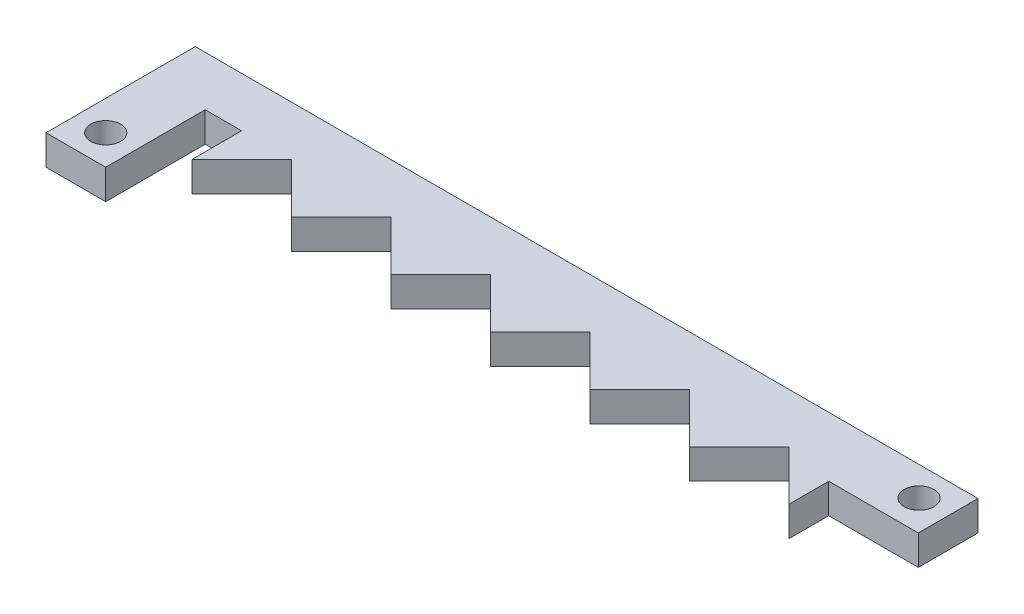
ISO-10303-21;
HEADER;
FILE_DESCRIPTION(('STEP AP214'),'2;1');
FILE_NAME('part.step','',(''),(''),'','','');
FILE_SCHEMA(('AUTOMOTIVE_DESIGN { 1 0 10303 214 1 1 1 1 }'));
ENDSEC;
DATA;
#1=APPLICATION_CONTEXT('core data for automotive mechanical design processes');
#2=APPLICATION_PROTOCOL_DEFINITION('international standard','automotive_design',2000,#1);
#3=PRODUCT_CONTEXT('',#1,'mechanical');
#4=PRODUCT('Part','Part','',(#3));
#5=PRODUCT_RELATED_PRODUCT_CATEGORY('part','',(#4));
#6=PRODUCT_DEFINITION_FORMATION('','',#4);
#7=PRODUCT_DEFINITION_CONTEXT('part definition',#1,'design');
#8=PRODUCT_DEFINITION('design','',#6,#7);
#9=PRODUCT_DEFINITION_SHAPE('','',#8);
#10=(LENGTH_UNIT() NAMED_UNIT(*) SI_UNIT(.MILLI.,.METRE.));
#11=(NAMED_UNIT(*) PLANE_ANGLE_UNIT() SI_UNIT($,.RADIAN.));
#12=(NAMED_UNIT(*) SI_UNIT($,.STERADIAN.) SOLID_ANGLE_UNIT());
#13=UNCERTAINTY_MEASURE_WITH_UNIT(LENGTH_MEASURE(1.E-05),#10,'distance_accuracy_value','');
#14=(GEOMETRIC_REPRESENTATION_CONTEXT(3) GLOBAL_UNCERTAINTY_ASSIGNED_CONTEXT((#13)) GLOBAL_UNIT_ASSIGNED_CONTEXT((#10,
#11,#12)) REPRESENTATION_CONTEXT('',''));
#15=CARTESIAN_POINT('',(0.,0.,0.));
#16=DIRECTION('',(0.,0.,1.));
#17=DIRECTION('',(1.,0.,0.));
#18=AXIS2_PLACEMENT_3D('',#15,#16,#17);
#19=CARTESIAN_POINT('',(0.,3.,0.));
#20=DIRECTION('',(0.,1.,0.));
#21=DIRECTION('',(0.,0.,1.));
#22=AXIS2_PLACEMENT_3D('',#19,#20,#21);
#23=PLANE('',#22);
#24=CARTESIAN_POINT('',(-4.89117150595901,3.,-32.4839929964549));
#25=DIRECTION('',(0.,1.,0.));
#26=DIRECTION('',(0.,0.,1.));
#27=AXIS2_PLACEMENT_3D('',#24,#25,#26);
#28=CIRCLE('',#27,1.5);
#29=CARTESIAN_POINT('',(-4.89117150595901,3.,-30.9839929964549));
#30=VERTEX_POINT('',#29);
#31=EDGE_CURVE('E213',#30,#30,#28,.T.);
#32=ORIENTED_EDGE('',*,*,#31,.F.);
#33=EDGE_LOOP('',(#32));
#34=FACE_BOUND('',#33,.T.);
#35=DIRECTION('',(-1.,0.,0.));
#36=VECTOR('',#35,1.);
#37=CARTESIAN_POINT('',(0.999999999999988,3.,-44.4839929964549));
#38=LINE('',#37,#36);
#39=CARTESIAN_POINT('',(70.7657568622883,3.,-44.4839929964549));
#40=VERTEX_POINT('',#39);
#41=CARTESIAN_POINT('',(-7.89117150595901,3.,-44.4839929964549));
#42=VERTEX_POINT('',#41);
#43=EDGE_CURVE('E52',#40,#42,#38,.T.);
#44=ORIENTED_EDGE('',*,*,#43,.T.);
#45=DIRECTION('',(0.,0.,1.));
#46=VECTOR('',#45,1.);
#47=CARTESIAN_POINT('',(-7.89117150595901,3.,-44.4839929964549));
#48=LINE('',#47,#46);
#49=CARTESIAN_POINT('',(-7.89117150595901,3.,-29.4839929964549));
#50=VERTEX_POINT('',#49);
#51=EDGE_CURVE('E364',#42,#50,#48,.T.);
#52=ORIENTED_EDGE('',*,*,#51,.T.);
#53=DIRECTION('',(1.,0.,0.));
#54=VECTOR('',#53,1.);
#55=CARTESIAN_POINT('',(-7.89117150595901,3.,-29.4839929964549));
#56=LINE('',#55,#54);
#57=CARTESIAN_POINT('',(-1.89117150595901,3.,-29.4839929964549));
#58=VERTEX_POINT('',#57);
#59=EDGE_CURVE('E304',#50,#58,#56,.T.);
#60=ORIENTED_EDGE('',*,*,#59,.T.);
#61=DIRECTION('',(0.,0.,-1.));
#62=VECTOR('',#61,1.);
#63=CARTESIAN_POINT('',(-1.89117150595901,3.,-29.4839929964549));
#64=LINE('',#63,#62);
#65=CARTESIAN_POINT('',(-1.89117150595901,3.,-39.4839929964549));
#66=VERTEX_POINT('',#65);
#67=EDGE_CURVE('E326',#58,#66,#64,.T.);
#68=ORIENTED_EDGE('',*,*,#67,.T.);
#69=DIRECTION('',(1.,0.,0.));
#70=VECTOR('',#69,1.);
#71=CARTESIAN_POINT('',(-1.89117150595901,3.,-39.4839929964549));
#72=LINE('',#71,#70);
#73=CARTESIAN_POINT('',(1.76575686228831,3.,-39.4839929964549));
#74=VERTEX_POINT('',#73);
#75=EDGE_CURVE('E323',#66,#74,#72,.T.);
#76=ORIENTED_EDGE('',*,*,#75,.T.);
#77=DIRECTION('',(0.,0.,1.));
#78=VECTOR('',#77,1.);
#79=CARTESIAN_POINT('',(1.76575686228831,3.,-39.4839929964549));
#80=LINE('',#79,#78);
#81=CARTESIAN_POINT('',(1.76575686228832,3.,-34.4839929964549));
#82=VERTEX_POINT('',#81);
#83=EDGE_CURVE('E325',#74,#82,#80,.T.);
#84=ORIENTED_EDGE('',*,*,#83,.T.);
#85=DIRECTION('',(0.707106781186548,0.,-0.707106781186547));
#86=VECTOR('',#85,1.);
#87=CARTESIAN_POINT('',(1.76575686228832,3.,-34.4839929964549));
#88=LINE('',#87,#86);
#89=CARTESIAN_POINT('',(6.76575686228832,3.,-39.4839929964549));
#90=VERTEX_POINT('',#89);
#91=EDGE_CURVE('E328',#82,#90,#88,.T.);
#92=ORIENTED_EDGE('',*,*,#91,.T.);
#93=DIRECTION('',(0.707106781186547,0.,0.707106781186548));
#94=VECTOR('',#93,1.);
#95=CARTESIAN_POINT('',(6.76575686228832,3.,-39.4839929964549));
#96=LINE('',#95,#94);
#97=CARTESIAN_POINT('',(11.7657568622883,3.,-34.4839929964549));
#98=VERTEX_POINT('',#97);
#99=EDGE_CURVE('E334',#90,#98,#96,.T.);
#100=ORIENTED_EDGE('',*,*,#99,.T.);
#101=DIRECTION('',(0.707106781186547,0.,-0.707106781186548));
#102=VECTOR('',#101,1.);
#103=CARTESIAN_POINT('',(11.7657568622883,3.,-34.4839929964549));
#104=LINE('',#103,#102);
#105=CARTESIAN_POINT('',(16.7657568622883,3.,-39.4839929964549));
#106=VERTEX_POINT('',#105);
#107=EDGE_CURVE('E336',#98,#106,#104,.T.);
#108=ORIENTED_EDGE('',*,*,#107,.T.);
#109=DIRECTION('',(0.707106781186548,0.,0.707106781186547));
#110=VECTOR('',#109,1.);
#111=CARTESIAN_POINT('',(16.7657568622883,3.,-39.4839929964549));
#112=LINE('',#111,#110);
#113=CARTESIAN_POINT('',(21.7657568622883,3.,-34.4839929964549));
#114=VERTEX_POINT('',#113);
#115=EDGE_CURVE('E338',#106,#114,#112,.T.);
#116=ORIENTED_EDGE('',*,*,#115,.T.);
#117=DIRECTION('',(0.707106781186548,0.,-0.707106781186547));
#118=VECTOR('',#117,1.);
#119=CARTESIAN_POINT('',(21.7657568622883,3.,-34.4839929964549));
#120=LINE('',#119,#118);
#121=CARTESIAN_POINT('',(26.7657568622883,3.,-39.4839929964549));
#122=VERTEX_POINT('',#121);
#123=EDGE_CURVE('E340',#114,#122,#120,.T.);
#124=ORIENTED_EDGE('',*,*,#123,.T.);
#125=DIRECTION('',(0.707106781186547,0.,0.707106781186547));
#126=VECTOR('',#125,1.);
#127=CARTESIAN_POINT('',(26.7657568622883,3.,-39.4839929964549));
#128=LINE('',#127,#126);
#129=CARTESIAN_POINT('',(31.7657568622883,3.,-34.4839929964549));
#130=VERTEX_POINT('',#129);
#131=EDGE_CURVE('E342',#122,#130,#128,.T.);
#132=ORIENTED_EDGE('',*,*,#131,.T.);
#133=DIRECTION('',(0.707106781186547,0.,-0.707106781186547));
#134=VECTOR('',#133,1.);
#135=CARTESIAN_POINT('',(31.7657568622883,3.,-34.4839929964549));
#136=LINE('',#135,#134);
#137=CARTESIAN_POINT('',(36.7657568622883,3.,-39.4839929964549));
#138=VERTEX_POINT('',#137);
#139=EDGE_CURVE('E344',#130,#138,#136,.T.);
#140=ORIENTED_EDGE('',*,*,#139,.T.);
#141=DIRECTION('',(0.707106781186548,0.,0.707106781186547));
#142=VECTOR('',#141,1.);
#143=CARTESIAN_POINT('',(36.7657568622883,3.,-39.4839929964549));
#144=LINE('',#143,#142);
#145=CARTESIAN_POINT('',(41.7657568622883,3.,-34.4839929964549));
#146=VERTEX_POINT('',#145);
#147=EDGE_CURVE('E346',#138,#146,#144,.T.);
#148=ORIENTED_EDGE('',*,*,#147,.T.);
#149=DIRECTION('',(0.707106781186547,0.,-0.707106781186547));
#150=VECTOR('',#149,1.);
#151=CARTESIAN_POINT('',(41.7657568622883,3.,-34.4839929964549));
#152=LINE('',#151,#150);
#153=CARTESIAN_POINT('',(46.7657568622883,3.,-39.4839929964549));
#154=VERTEX_POINT('',#153);
#155=EDGE_CURVE('E348',#146,#154,#152,.T.);
#156=ORIENTED_EDGE('',*,*,#155,.T.);
#157=DIRECTION('',(0.707106781186548,0.,0.707106781186547));
#158=VECTOR('',#157,1.);
#159=CARTESIAN_POINT('',(46.7657568622883,3.,-39.4839929964549));
#160=LINE('',#159,#158);
#161=CARTESIAN_POINT('',(51.7657568622883,3.,-34.4839929964549));
#162=VERTEX_POINT('',#161);
#163=EDGE_CURVE('E350',#154,#162,#160,.T.);
#164=ORIENTED_EDGE('',*,*,#163,.T.);
#165=DIRECTION('',(0.707106781186547,0.,-0.707106781186547));
#166=VECTOR('',#165,1.);
#167=CARTESIAN_POINT('',(51.7657568622883,3.,-34.4839929964549));
#168=LINE('',#167,#166);
#169=CARTESIAN_POINT('',(56.7657568622883,3.,-39.4839929964549));
#170=VERTEX_POINT('',#169);
#171=EDGE_CURVE('E352',#162,#170,#168,.T.);
#172=ORIENTED_EDGE('',*,*,#171,.T.);
#173=DIRECTION('',(0.707106781186547,0.,0.707106781186548));
#174=VECTOR('',#173,1.);
#175=CARTESIAN_POINT('',(56.7657568622883,3.,-39.4839929964549));
#176=LINE('',#175,#174);
#177=CARTESIAN_POINT('',(61.7657568622883,3.,-34.4839929964549));
#178=VERTEX_POINT('',#177);
#179=EDGE_CURVE('E190',#170,#178,#176,.T.);
#180=ORIENTED_EDGE('',*,*,#179,.T.);
#181=DIRECTION('',(0.,0.,-1.));
#182=VECTOR('',#181,1.);
#183=CARTESIAN_POINT('',(61.7657568622883,3.,-38.4839929964549));
#184=LINE('',#183,#182);
#185=CARTESIAN_POINT('',(61.7657568622883,3.,-38.4839929964549));
#186=VERTEX_POINT('',#185);
#187=EDGE_CURVE('E184',#178,#186,#184,.T.);
#188=ORIENTED_EDGE('',*,*,#187,.T.);
#189=DIRECTION('',(1.,0.,0.));
#190=VECTOR('',#189,1.);
#191=CARTESIAN_POINT('',(70.7657568622883,3.,-38.4839929964549));
#192=LINE('',#191,#190);
#193=CARTESIAN_POINT('',(70.7657568622883,3.,-38.4839929964549));
#194=VERTEX_POINT('',#193);
#195=EDGE_CURVE('E188',#186,#194,#192,.T.);
#196=ORIENTED_EDGE('',*,*,#195,.T.);
#197=DIRECTION('',(0.,0.,-1.));
#198=VECTOR('',#197,1.);
#199=CARTESIAN_POINT('',(70.7657568622883,3.,-44.4839929964549));
#200=LINE('',#199,#198);
#201=EDGE_CURVE('E204',#194,#40,#200,.T.);
#202=ORIENTED_EDGE('',*,*,#201,.T.);
#203=EDGE_LOOP('',(#44,#52,#60,#68,#76,#84,#92,#100,#108,#116,#124,#132,#140,#148,#156,#164,
#172,#180,#188,#196,#202));
#204=FACE_BOUND('',#203,.T.);
#205=CARTESIAN_POINT('',(67.7657568622883,3.,-41.5577577112208));
#206=DIRECTION('',(0.,1.,0.));
#207=DIRECTION('',(0.,0.,1.));
#208=AXIS2_PLACEMENT_3D('',#205,#206,#207);
#209=CIRCLE('',#208,1.5);
#210=CARTESIAN_POINT('',(67.7657568622883,3.,-40.0577577112209));
#211=VERTEX_POINT('',#210);
#212=EDGE_CURVE('E371',#211,#211,#209,.T.);
#213=ORIENTED_EDGE('',*,*,#212,.F.);
#214=EDGE_LOOP('',(#213));
#215=FACE_BOUND('',#214,.T.);
#216=ADVANCED_FACE('F35',(#34,#204,#215),#23,.T.);
#217=CARTESIAN_POINT('',(0.,0.,0.));
#218=DIRECTION('',(0.,1.,0.));
#219=DIRECTION('',(0.,0.,1.));
#220=AXIS2_PLACEMENT_3D('',#217,#218,#219);
#221=PLANE('',#220);
#222=DIRECTION('',(0.,0.,1.));
#223=VECTOR('',#222,1.);
#224=CARTESIAN_POINT('',(-7.89117150595901,0.,-44.4839929964549));
#225=LINE('',#224,#223);
#226=CARTESIAN_POINT('',(-7.89117150595901,0.,-44.4839929964549));
#227=VERTEX_POINT('',#226);
#228=CARTESIAN_POINT('',(-7.89117150595901,0.,-29.4839929964549));
#229=VERTEX_POINT('',#228);
#230=EDGE_CURVE('E210',#227,#229,#225,.T.);
#231=ORIENTED_EDGE('',*,*,#230,.F.);
#232=DIRECTION('',(-1.,0.,0.));
#233=VECTOR('',#232,1.);
#234=CARTESIAN_POINT('',(0.999999999999988,0.,-44.4839929964549));
#235=LINE('',#234,#233);
#236=CARTESIAN_POINT('',(70.7657568622883,0.,-44.4839929964549));
#237=VERTEX_POINT('',#236);
#238=EDGE_CURVE('E248',#237,#227,#235,.T.);
#239=ORIENTED_EDGE('',*,*,#238,.F.);
#240=DIRECTION('',(0.,0.,-1.));
#241=VECTOR('',#240,1.);
#242=CARTESIAN_POINT('',(70.7657568622883,0.,-44.4839929964549));
#243=LINE('',#242,#241);
#244=CARTESIAN_POINT('',(70.7657568622883,0.,-38.4839929964549));
#245=VERTEX_POINT('',#244);
#246=EDGE_CURVE('E128',#245,#237,#243,.T.);
#247=ORIENTED_EDGE('',*,*,#246,.F.);
#248=DIRECTION('',(1.,0.,0.));
#249=VECTOR('',#248,1.);
#250=CARTESIAN_POINT('',(70.7657568622883,0.,-38.4839929964549));
#251=LINE('',#250,#249);
#252=CARTESIAN_POINT('',(61.7657568622883,0.,-38.4839929964549));
#253=VERTEX_POINT('',#252);
#254=EDGE_CURVE('E121',#253,#245,#251,.T.);
#255=ORIENTED_EDGE('',*,*,#254,.F.);
#256=DIRECTION('',(0.,0.,-1.));
#257=VECTOR('',#256,1.);
#258=CARTESIAN_POINT('',(61.7657568622883,0.,-38.4839929964549));
#259=LINE('',#258,#257);
#260=CARTESIAN_POINT('',(61.7657568622883,0.,-34.4839929964549));
#261=VERTEX_POINT('',#260);
#262=EDGE_CURVE('E198',#261,#253,#259,.T.);
#263=ORIENTED_EDGE('',*,*,#262,.F.);
#264=DIRECTION('',(0.707106781186547,0.,0.707106781186548));
#265=VECTOR('',#264,1.);
#266=CARTESIAN_POINT('',(56.7657568622883,0.,-39.4839929964549));
#267=LINE('',#266,#265);
#268=CARTESIAN_POINT('',(56.7657568622883,0.,-39.4839929964549));
#269=VERTEX_POINT('',#268);
#270=EDGE_CURVE('E243',#269,#261,#267,.T.);
#271=ORIENTED_EDGE('',*,*,#270,.F.);
#272=DIRECTION('',(0.707106781186547,0.,-0.707106781186547));
#273=VECTOR('',#272,1.);
#274=CARTESIAN_POINT('',(51.7657568622883,0.,-34.4839929964549));
#275=LINE('',#274,#273);
#276=CARTESIAN_POINT('',(51.7657568622883,0.,-34.4839929964549));
#277=VERTEX_POINT('',#276);
#278=EDGE_CURVE('E241',#277,#269,#275,.T.);
#279=ORIENTED_EDGE('',*,*,#278,.F.);
#280=DIRECTION('',(0.707106781186548,0.,0.707106781186547));
#281=VECTOR('',#280,1.);
#282=CARTESIAN_POINT('',(46.7657568622883,0.,-39.4839929964549));
#283=LINE('',#282,#281);
#284=CARTESIAN_POINT('',(46.7657568622883,0.,-39.4839929964549));
#285=VERTEX_POINT('',#284);
#286=EDGE_CURVE('E239',#285,#277,#283,.T.);
#287=ORIENTED_EDGE('',*,*,#286,.F.);
#288=DIRECTION('',(0.707106781186547,0.,-0.707106781186547));
#289=VECTOR('',#288,1.);
#290=CARTESIAN_POINT('',(41.7657568622883,0.,-34.4839929964549));
#291=LINE('',#290,#289);
#292=CARTESIAN_POINT('',(41.7657568622883,0.,-34.4839929964549));
#293=VERTEX_POINT('',#292);
#294=EDGE_CURVE('E237',#293,#285,#291,.T.);
#295=ORIENTED_EDGE('',*,*,#294,.F.);
#296=DIRECTION('',(0.707106781186548,0.,0.707106781186547));
#297=VECTOR('',#296,1.);
#298=CARTESIAN_POINT('',(36.7657568622883,0.,-39.4839929964549));
#299=LINE('',#298,#297);
#300=CARTESIAN_POINT('',(36.7657568622883,0.,-39.4839929964549));
#301=VERTEX_POINT('',#300);
#302=EDGE_CURVE('E235',#301,#293,#299,.T.);
#303=ORIENTED_EDGE('',*,*,#302,.F.);
#304=DIRECTION('',(0.707106781186547,0.,-0.707106781186547));
#305=VECTOR('',#304,1.);
#306=CARTESIAN_POINT('',(31.7657568622883,0.,-34.4839929964549));
#307=LINE('',#306,#305);
#308=CARTESIAN_POINT('',(31.7657568622883,0.,-34.4839929964549));
#309=VERTEX_POINT('',#308);
#310=EDGE_CURVE('E233',#309,#301,#307,.T.);
#311=ORIENTED_EDGE('',*,*,#310,.F.);
#312=DIRECTION('',(0.707106781186547,0.,0.707106781186547));
#313=VECTOR('',#312,1.);
#314=CARTESIAN_POINT('',(26.7657568622883,0.,-39.4839929964549));
#315=LINE('',#314,#313);
#316=CARTESIAN_POINT('',(26.7657568622883,0.,-39.4839929964549));
#317=VERTEX_POINT('',#316);
#318=EDGE_CURVE('E231',#317,#309,#315,.T.);
#319=ORIENTED_EDGE('',*,*,#318,.F.);
#320=DIRECTION('',(0.707106781186548,0.,-0.707106781186547));
#321=VECTOR('',#320,1.);
#322=CARTESIAN_POINT('',(21.7657568622883,0.,-34.4839929964549));
#323=LINE('',#322,#321);
#324=CARTESIAN_POINT('',(21.7657568622883,0.,-34.4839929964549));
#325=VERTEX_POINT('',#324);
#326=EDGE_CURVE('E229',#325,#317,#323,.T.);
#327=ORIENTED_EDGE('',*,*,#326,.F.);
#328=DIRECTION('',(0.707106781186548,0.,0.707106781186547));
#329=VECTOR('',#328,1.);
#330=CARTESIAN_POINT('',(16.7657568622883,0.,-39.4839929964549));
#331=LINE('',#330,#329);
#332=CARTESIAN_POINT('',(16.7657568622883,0.,-39.4839929964549));
#333=VERTEX_POINT('',#332);
#334=EDGE_CURVE('E227',#333,#325,#331,.T.);
#335=ORIENTED_EDGE('',*,*,#334,.F.);
#336=DIRECTION('',(0.707106781186547,0.,-0.707106781186548));
#337=VECTOR('',#336,1.);
#338=CARTESIAN_POINT('',(11.7657568622883,0.,-34.4839929964549));
#339=LINE('',#338,#337);
#340=CARTESIAN_POINT('',(11.7657568622883,0.,-34.4839929964549));
#341=VERTEX_POINT('',#340);
#342=EDGE_CURVE('E225',#341,#333,#339,.T.);
#343=ORIENTED_EDGE('',*,*,#342,.F.);
#344=DIRECTION('',(0.707106781186547,0.,0.707106781186548));
#345=VECTOR('',#344,1.);
#346=CARTESIAN_POINT('',(6.76575686228832,0.,-39.4839929964549));
#347=LINE('',#346,#345);
#348=CARTESIAN_POINT('',(6.76575686228832,0.,-39.4839929964549));
#349=VERTEX_POINT('',#348);
#350=EDGE_CURVE('E223',#349,#341,#347,.T.);
#351=ORIENTED_EDGE('',*,*,#350,.F.);
#352=DIRECTION('',(0.707106781186548,0.,-0.707106781186547));
#353=VECTOR('',#352,1.);
#354=CARTESIAN_POINT('',(1.76575686228832,0.,-34.4839929964549));
#355=LINE('',#354,#353);
#356=CARTESIAN_POINT('',(1.76575686228832,0.,-34.4839929964549));
#357=VERTEX_POINT('',#356);
#358=EDGE_CURVE('E221',#357,#349,#355,.T.);
#359=ORIENTED_EDGE('',*,*,#358,.F.);
#360=DIRECTION('',(0.,0.,1.));
#361=VECTOR('',#360,1.);
#362=CARTESIAN_POINT('',(1.76575686228831,0.,-39.4839929964549));
#363=LINE('',#362,#361);
#364=CARTESIAN_POINT('',(1.76575686228831,0.,-39.4839929964549));
#365=VERTEX_POINT('',#364);
#366=EDGE_CURVE('E219',#365,#357,#363,.T.);
#367=ORIENTED_EDGE('',*,*,#366,.F.);
#368=DIRECTION('',(1.,0.,0.));
#369=VECTOR('',#368,1.);
#370=CARTESIAN_POINT('',(-1.89117150595901,0.,-39.4839929964549));
#371=LINE('',#370,#369);
#372=CARTESIAN_POINT('',(-1.89117150595901,0.,-39.4839929964549));
#373=VERTEX_POINT('',#372);
#374=EDGE_CURVE('E217',#373,#365,#371,.T.);
#375=ORIENTED_EDGE('',*,*,#374,.F.);
#376=DIRECTION('',(0.,0.,-1.));
#377=VECTOR('',#376,1.);
#378=CARTESIAN_POINT('',(-1.89117150595901,0.,-29.4839929964549));
#379=LINE('',#378,#377);
#380=CARTESIAN_POINT('',(-1.89117150595901,0.,-29.4839929964549));
#381=VERTEX_POINT('',#380);
#382=EDGE_CURVE('E215',#381,#373,#379,.T.);
#383=ORIENTED_EDGE('',*,*,#382,.F.);
#384=DIRECTION('',(1.,0.,0.));
#385=VECTOR('',#384,1.);
#386=CARTESIAN_POINT('',(-7.89117150595901,0.,-29.4839929964549));
#387=LINE('',#386,#385);
#388=EDGE_CURVE('E212',#229,#381,#387,.T.);
#389=ORIENTED_EDGE('',*,*,#388,.F.);
#390=EDGE_LOOP('',(#231,#239,#247,#255,#263,#271,#279,#287,#295,#303,#311,#319,#327,#335,#343,
#351,#359,#367,#375,#383,#389));
#391=FACE_BOUND('',#390,.T.);
#392=CARTESIAN_POINT('',(-4.89117150595901,0.,-32.4839929964549));
#393=DIRECTION('',(0.,1.,0.));
#394=DIRECTION('',(0.,0.,1.));
#395=AXIS2_PLACEMENT_3D('',#392,#393,#394);
#396=CIRCLE('',#395,1.5);
#397=CARTESIAN_POINT('',(-4.89117150595901,0.,-30.9839929964549));
#398=VERTEX_POINT('',#397);
#399=EDGE_CURVE('E368',#398,#398,#396,.T.);
#400=ORIENTED_EDGE('',*,*,#399,.T.);
#401=EDGE_LOOP('',(#400));
#402=FACE_BOUND('',#401,.T.);
#403=CARTESIAN_POINT('',(67.7657568622883,0.,-41.5577577112208));
#404=DIRECTION('',(0.,1.,0.));
#405=DIRECTION('',(0.,0.,1.));
#406=AXIS2_PLACEMENT_3D('',#403,#404,#405);
#407=CIRCLE('',#406,1.5);
#408=CARTESIAN_POINT('',(67.7657568622883,0.,-40.0577577112209));
#409=VERTEX_POINT('',#408);
#410=EDGE_CURVE('E374',#409,#409,#407,.T.);
#411=ORIENTED_EDGE('',*,*,#410,.T.);
#412=EDGE_LOOP('',(#411));
#413=FACE_BOUND('',#412,.T.);
#414=ADVANCED_FACE('F310',(#391,#402,#413),#221,.F.);
#415=CARTESIAN_POINT('',(-7.89117150595901,3.,-44.4839929964549));
#416=DIRECTION('',(1.,0.,0.));
#417=DIRECTION('',(0.,0.,-1.));
#418=AXIS2_PLACEMENT_3D('',#415,#416,#417);
#419=PLANE('',#418);
#420=ORIENTED_EDGE('',*,*,#230,.T.);
#421=DIRECTION('',(0.,-1.,0.));
#422=VECTOR('',#421,1.);
#423=CARTESIAN_POINT('',(-7.89117150595901,3.,-29.4839929964549));
#424=LINE('',#423,#422);
#425=EDGE_CURVE('E44',#50,#229,#424,.T.);
#426=ORIENTED_EDGE('',*,*,#425,.F.);
#427=ORIENTED_EDGE('',*,*,#51,.F.);
#428=DIRECTION('',(0.,-1.,0.));
#429=VECTOR('',#428,1.);
#430=CARTESIAN_POINT('',(-7.89117150595901,3.,-44.4839929964549));
#431=LINE('',#430,#429);
#432=EDGE_CURVE('E11',#42,#227,#431,.T.);
#433=ORIENTED_EDGE('',*,*,#432,.T.);
#434=EDGE_LOOP('',(#420,#426,#427,#433));
#435=FACE_BOUND('',#434,.T.);
#436=ADVANCED_FACE('F37',(#435),#419,.F.);
#437=CARTESIAN_POINT('',(-7.89117150595901,3.,-29.4839929964549));
#438=DIRECTION('',(0.,0.,-1.));
#439=DIRECTION('',(-1.,0.,0.));
#440=AXIS2_PLACEMENT_3D('',#437,#438,#439);
#441=PLANE('',#440);
#442=ORIENTED_EDGE('',*,*,#388,.T.);
#443=DIRECTION('',(0.,-1.,0.));
#444=VECTOR('',#443,1.);
#445=CARTESIAN_POINT('',(-1.89117150595901,3.,-29.4839929964549));
#446=LINE('',#445,#444);
#447=EDGE_CURVE('E295',#58,#381,#446,.T.);
#448=ORIENTED_EDGE('',*,*,#447,.F.);
#449=ORIENTED_EDGE('',*,*,#59,.F.);
#450=ORIENTED_EDGE('',*,*,#425,.T.);
#451=EDGE_LOOP('',(#442,#448,#449,#450));
#452=FACE_BOUND('',#451,.T.);
#453=ADVANCED_FACE('F302',(#452),#441,.F.);
#454=CARTESIAN_POINT('',(-1.89117150595901,3.,-29.4839929964549));
#455=DIRECTION('',(-1.,0.,0.));
#456=DIRECTION('',(0.,0.,1.));
#457=AXIS2_PLACEMENT_3D('',#454,#455,#456);
#458=PLANE('',#457);
#459=ORIENTED_EDGE('',*,*,#382,.T.);
#460=DIRECTION('',(0.,-1.,0.));
#461=VECTOR('',#460,1.);
#462=CARTESIAN_POINT('',(-1.89117150595901,3.,-39.4839929964549));
#463=LINE('',#462,#461);
#464=EDGE_CURVE('E292',#66,#373,#463,.T.);
#465=ORIENTED_EDGE('',*,*,#464,.F.);
#466=ORIENTED_EDGE('',*,*,#67,.F.);
#467=ORIENTED_EDGE('',*,*,#447,.T.);
#468=EDGE_LOOP('',(#459,#465,#466,#467));
#469=FACE_BOUND('',#468,.T.);
#470=ADVANCED_FACE('F317',(#469),#458,.F.);
#471=CARTESIAN_POINT('',(-1.89117150595901,3.,-39.4839929964549));
#472=DIRECTION('',(0.,0.,-1.));
#473=DIRECTION('',(-1.,0.,0.));
#474=AXIS2_PLACEMENT_3D('',#471,#472,#473);
#475=PLANE('',#474);
#476=ORIENTED_EDGE('',*,*,#374,.T.);
#477=DIRECTION('',(0.,-1.,0.));
#478=VECTOR('',#477,1.);
#479=CARTESIAN_POINT('',(1.76575686228831,3.,-39.4839929964549));
#480=LINE('',#479,#478);
#481=EDGE_CURVE('E289',#74,#365,#480,.T.);
#482=ORIENTED_EDGE('',*,*,#481,.F.);
#483=ORIENTED_EDGE('',*,*,#75,.F.);
#484=ORIENTED_EDGE('',*,*,#464,.T.);
#485=EDGE_LOOP('',(#476,#482,#483,#484));
#486=FACE_BOUND('',#485,.T.);
#487=ADVANCED_FACE('F321',(#486),#475,.F.);
#488=CARTESIAN_POINT('',(1.76575686228831,3.,-39.4839929964549));
#489=DIRECTION('',(1.,0.,0.));
#490=DIRECTION('',(0.,0.,-1.));
#491=AXIS2_PLACEMENT_3D('',#488,#489,#490);
#492=PLANE('',#491);
#493=ORIENTED_EDGE('',*,*,#366,.T.);
#494=DIRECTION('',(0.,-1.,0.));
#495=VECTOR('',#494,1.);
#496=CARTESIAN_POINT('',(1.76575686228832,3.,-34.4839929964549));
#497=LINE('',#496,#495);
#498=EDGE_CURVE('E286',#82,#357,#497,.T.);
#499=ORIENTED_EDGE('',*,*,#498,.F.);
#500=ORIENTED_EDGE('',*,*,#83,.F.);
#501=ORIENTED_EDGE('',*,*,#481,.T.);
#502=EDGE_LOOP('',(#493,#499,#500,#501));
#503=FACE_BOUND('',#502,.T.);
#504=ADVANCED_FACE('F446',(#503),#492,.F.);
#505=CARTESIAN_POINT('',(1.76575686228832,3.,-34.4839929964549));
#506=DIRECTION('',(-0.707106781186547,0.,-0.707106781186548));
#507=DIRECTION('',(-0.707106781186548,0.,0.707106781186547));
#508=AXIS2_PLACEMENT_3D('',#505,#506,#507);
#509=PLANE('',#508);
#510=ORIENTED_EDGE('',*,*,#358,.T.);
#511=DIRECTION('',(0.,-1.,0.));
#512=VECTOR('',#511,1.);
#513=CARTESIAN_POINT('',(6.76575686228832,3.,-39.4839929964549));
#514=LINE('',#513,#512);
#515=EDGE_CURVE('E283',#90,#349,#514,.T.);
#516=ORIENTED_EDGE('',*,*,#515,.F.);
#517=ORIENTED_EDGE('',*,*,#91,.F.);
#518=ORIENTED_EDGE('',*,*,#498,.T.);
#519=EDGE_LOOP('',(#510,#516,#517,#518));
#520=FACE_BOUND('',#519,.T.);
#521=ADVANCED_FACE('F442',(#520),#509,.F.);
#522=CARTESIAN_POINT('',(6.76575686228832,3.,-39.4839929964549));
#523=DIRECTION('',(0.707106781186548,0.,-0.707106781186547));
#524=DIRECTION('',(-0.707106781186547,0.,-0.707106781186548));
#525=AXIS2_PLACEMENT_3D('',#522,#523,#524);
#526=PLANE('',#525);
#527=ORIENTED_EDGE('',*,*,#350,.T.);
#528=DIRECTION('',(0.,-1.,0.));
#529=VECTOR('',#528,1.);
#530=CARTESIAN_POINT('',(11.7657568622883,3.,-34.4839929964549));
#531=LINE('',#530,#529);
#532=EDGE_CURVE('E280',#98,#341,#531,.T.);
#533=ORIENTED_EDGE('',*,*,#532,.F.);
#534=ORIENTED_EDGE('',*,*,#99,.F.);
#535=ORIENTED_EDGE('',*,*,#515,.T.);
#536=EDGE_LOOP('',(#527,#533,#534,#535));
#537=FACE_BOUND('',#536,.T.);
#538=ADVANCED_FACE('F438',(#537),#526,.F.);
#539=CARTESIAN_POINT('',(11.7657568622883,3.,-34.4839929964549));
#540=DIRECTION('',(-0.707106781186548,0.,-0.707106781186547));
#541=DIRECTION('',(-0.707106781186547,0.,0.707106781186548));
#542=AXIS2_PLACEMENT_3D('',#539,#540,#541);
#543=PLANE('',#542);
#544=ORIENTED_EDGE('',*,*,#342,.T.);
#545=DIRECTION('',(0.,-1.,0.));
#546=VECTOR('',#545,1.);
#547=CARTESIAN_POINT('',(16.7657568622883,3.,-39.4839929964549));
#548=LINE('',#547,#546);
#549=EDGE_CURVE('E277',#106,#333,#548,.T.);
#550=ORIENTED_EDGE('',*,*,#549,.F.);
#551=ORIENTED_EDGE('',*,*,#107,.F.);
#552=ORIENTED_EDGE('',*,*,#532,.T.);
#553=EDGE_LOOP('',(#544,#550,#551,#552));
#554=FACE_BOUND('',#553,.T.);
#555=ADVANCED_FACE('F434',(#554),#543,.F.);
#556=CARTESIAN_POINT('',(16.7657568622883,3.,-39.4839929964549));
#557=DIRECTION('',(0.707106781186547,0.,-0.707106781186548));
#558=DIRECTION('',(-0.707106781186548,0.,-0.707106781186547));
#559=AXIS2_PLACEMENT_3D('',#556,#557,#558);
#560=PLANE('',#559);
#561=ORIENTED_EDGE('',*,*,#334,.T.);
#562=DIRECTION('',(0.,-1.,0.));
#563=VECTOR('',#562,1.);
#564=CARTESIAN_POINT('',(21.7657568622883,3.,-34.4839929964549));
#565=LINE('',#564,#563);
#566=EDGE_CURVE('E274',#114,#325,#565,.T.);
#567=ORIENTED_EDGE('',*,*,#566,.F.);
#568=ORIENTED_EDGE('',*,*,#115,.F.);
#569=ORIENTED_EDGE('',*,*,#549,.T.);
#570=EDGE_LOOP('',(#561,#567,#568,#569));
#571=FACE_BOUND('',#570,.T.);
#572=ADVANCED_FACE('F430',(#571),#560,.F.);
#573=CARTESIAN_POINT('',(21.7657568622883,3.,-34.4839929964549));
#574=DIRECTION('',(-0.707106781186547,0.,-0.707106781186548));
#575=DIRECTION('',(-0.707106781186548,0.,0.707106781186547));
#576=AXIS2_PLACEMENT_3D('',#573,#574,#575);
#577=PLANE('',#576);
#578=ORIENTED_EDGE('',*,*,#326,.T.);
#579=DIRECTION('',(0.,-1.,0.));
#580=VECTOR('',#579,1.);
#581=CARTESIAN_POINT('',(26.7657568622883,3.,-39.4839929964549));
#582=LINE('',#581,#580);
#583=EDGE_CURVE('E271',#122,#317,#582,.T.);
#584=ORIENTED_EDGE('',*,*,#583,.F.);
#585=ORIENTED_EDGE('',*,*,#123,.F.);
#586=ORIENTED_EDGE('',*,*,#566,.T.);
#587=EDGE_LOOP('',(#578,#584,#585,#586));
#588=FACE_BOUND('',#587,.T.);
#589=ADVANCED_FACE('F426',(#588),#577,.F.);
#590=CARTESIAN_POINT('',(26.7657568622883,3.,-39.4839929964549));
#591=DIRECTION('',(0.707106781186548,0.,-0.707106781186548));
#592=DIRECTION('',(-0.707106781186548,0.,-0.707106781186548));
#593=AXIS2_PLACEMENT_3D('',#590,#591,#592);
#594=PLANE('',#593);
#595=ORIENTED_EDGE('',*,*,#318,.T.);
#596=DIRECTION('',(0.,-1.,0.));
#597=VECTOR('',#596,1.);
#598=CARTESIAN_POINT('',(31.7657568622883,3.,-34.4839929964549));
#599=LINE('',#598,#597);
#600=EDGE_CURVE('E268',#130,#309,#599,.T.);
#601=ORIENTED_EDGE('',*,*,#600,.F.);
#602=ORIENTED_EDGE('',*,*,#131,.F.);
#603=ORIENTED_EDGE('',*,*,#583,.T.);
#604=EDGE_LOOP('',(#595,#601,#602,#603));
#605=FACE_BOUND('',#604,.T.);
#606=ADVANCED_FACE('F422',(#605),#594,.F.);
#607=CARTESIAN_POINT('',(31.7657568622883,3.,-34.4839929964549));
#608=DIRECTION('',(-0.707106781186548,0.,-0.707106781186548));
#609=DIRECTION('',(-0.707106781186548,0.,0.707106781186548));
#610=AXIS2_PLACEMENT_3D('',#607,#608,#609);
#611=PLANE('',#610);
#612=ORIENTED_EDGE('',*,*,#310,.T.);
#613=DIRECTION('',(0.,-1.,0.));
#614=VECTOR('',#613,1.);
#615=CARTESIAN_POINT('',(36.7657568622883,3.,-39.4839929964549));
#616=LINE('',#615,#614);
#617=EDGE_CURVE('E265',#138,#301,#616,.T.);
#618=ORIENTED_EDGE('',*,*,#617,.F.);
#619=ORIENTED_EDGE('',*,*,#139,.F.);
#620=ORIENTED_EDGE('',*,*,#600,.T.);
#621=EDGE_LOOP('',(#612,#618,#619,#620));
#622=FACE_BOUND('',#621,.T.);
#623=ADVANCED_FACE('F418',(#622),#611,.F.);
#624=CARTESIAN_POINT('',(36.7657568622883,3.,-39.4839929964549));
#625=DIRECTION('',(0.707106781186547,0.,-0.707106781186548));
#626=DIRECTION('',(-0.707106781186548,0.,-0.707106781186547));
#627=AXIS2_PLACEMENT_3D('',#624,#625,#626);
#628=PLANE('',#627);
#629=ORIENTED_EDGE('',*,*,#302,.T.);
#630=DIRECTION('',(0.,-1.,0.));
#631=VECTOR('',#630,1.);
#632=CARTESIAN_POINT('',(41.7657568622883,3.,-34.4839929964549));
#633=LINE('',#632,#631);
#634=EDGE_CURVE('E262',#146,#293,#633,.T.);
#635=ORIENTED_EDGE('',*,*,#634,.F.);
#636=ORIENTED_EDGE('',*,*,#147,.F.);
#637=ORIENTED_EDGE('',*,*,#617,.T.);
#638=EDGE_LOOP('',(#629,#635,#636,#637));
#639=FACE_BOUND('',#638,.T.);
#640=ADVANCED_FACE('F414',(#639),#628,.F.);
#641=CARTESIAN_POINT('',(41.7657568622883,3.,-34.4839929964549));
#642=DIRECTION('',(-0.707106781186548,0.,-0.707106781186548));
#643=DIRECTION('',(-0.707106781186548,0.,0.707106781186548));
#644=AXIS2_PLACEMENT_3D('',#641,#642,#643);
#645=PLANE('',#644);
#646=ORIENTED_EDGE('',*,*,#294,.T.);
#647=DIRECTION('',(0.,-1.,0.));
#648=VECTOR('',#647,1.);
#649=CARTESIAN_POINT('',(46.7657568622883,3.,-39.4839929964549));
#650=LINE('',#649,#648);
#651=EDGE_CURVE('E259',#154,#285,#650,.T.);
#652=ORIENTED_EDGE('',*,*,#651,.F.);
#653=ORIENTED_EDGE('',*,*,#155,.F.);
#654=ORIENTED_EDGE('',*,*,#634,.T.);
#655=EDGE_LOOP('',(#646,#652,#653,#654));
#656=FACE_BOUND('',#655,.T.);
#657=ADVANCED_FACE('F410',(#656),#645,.F.);
#658=CARTESIAN_POINT('',(46.7657568622883,3.,-39.4839929964549));
#659=DIRECTION('',(0.707106781186547,0.,-0.707106781186548));
#660=DIRECTION('',(-0.707106781186548,0.,-0.707106781186547));
#661=AXIS2_PLACEMENT_3D('',#658,#659,#660);
#662=PLANE('',#661);
#663=ORIENTED_EDGE('',*,*,#286,.T.);
#664=DIRECTION('',(0.,-1.,0.));
#665=VECTOR('',#664,1.);
#666=CARTESIAN_POINT('',(51.7657568622883,3.,-34.4839929964549));
#667=LINE('',#666,#665);
#668=EDGE_CURVE('E256',#162,#277,#667,.T.);
#669=ORIENTED_EDGE('',*,*,#668,.F.);
#670=ORIENTED_EDGE('',*,*,#163,.F.);
#671=ORIENTED_EDGE('',*,*,#651,.T.);
#672=EDGE_LOOP('',(#663,#669,#670,#671));
#673=FACE_BOUND('',#672,.T.);
#674=ADVANCED_FACE('F407',(#673),#662,.F.);
#675=CARTESIAN_POINT('',(51.7657568622883,3.,-34.4839929964549));
#676=DIRECTION('',(-0.707106781186548,0.,-0.707106781186548));
#677=DIRECTION('',(-0.707106781186548,0.,0.707106781186548));
#678=AXIS2_PLACEMENT_3D('',#675,#676,#677);
#679=PLANE('',#678);
#680=ORIENTED_EDGE('',*,*,#278,.T.);
#681=DIRECTION('',(0.,-1.,0.));
#682=VECTOR('',#681,1.);
#683=CARTESIAN_POINT('',(56.7657568622883,3.,-39.4839929964549));
#684=LINE('',#683,#682);
#685=EDGE_CURVE('E253',#170,#269,#684,.T.);
#686=ORIENTED_EDGE('',*,*,#685,.F.);
#687=ORIENTED_EDGE('',*,*,#171,.F.);
#688=ORIENTED_EDGE('',*,*,#668,.T.);
#689=EDGE_LOOP('',(#680,#686,#687,#688));
#690=FACE_BOUND('',#689,.T.);
#691=ADVANCED_FACE('F358',(#690),#679,.F.);
#692=CARTESIAN_POINT('',(56.7657568622883,3.,-39.4839929964549));
#693=DIRECTION('',(0.707106781186548,0.,-0.707106781186547));
#694=DIRECTION('',(-0.707106781186547,0.,-0.707106781186548));
#695=AXIS2_PLACEMENT_3D('',#692,#693,#694);
#696=PLANE('',#695);
#697=ORIENTED_EDGE('',*,*,#270,.T.);
#698=DIRECTION('',(0.,-1.,0.));
#699=VECTOR('',#698,1.);
#700=CARTESIAN_POINT('',(61.7657568622883,3.,-34.4839929964549));
#701=LINE('',#700,#699);
#702=EDGE_CURVE('E199',#178,#261,#701,.T.);
#703=ORIENTED_EDGE('',*,*,#702,.F.);
#704=ORIENTED_EDGE('',*,*,#179,.F.);
#705=ORIENTED_EDGE('',*,*,#685,.T.);
#706=EDGE_LOOP('',(#697,#703,#704,#705));
#707=FACE_BOUND('',#706,.T.);
#708=ADVANCED_FACE('F362',(#707),#696,.F.);
#709=CARTESIAN_POINT('',(61.7657568622883,3.,-38.4839929964549));
#710=DIRECTION('',(-1.,0.,0.));
#711=DIRECTION('',(0.,0.,1.));
#712=AXIS2_PLACEMENT_3D('',#709,#710,#711);
#713=PLANE('',#712);
#714=ORIENTED_EDGE('',*,*,#262,.T.);
#715=DIRECTION('',(0.,-1.,0.));
#716=VECTOR('',#715,1.);
#717=CARTESIAN_POINT('',(61.7657568622883,3.,-38.4839929964549));
#718=LINE('',#717,#716);
#719=EDGE_CURVE('E195',#186,#253,#718,.T.);
#720=ORIENTED_EDGE('',*,*,#719,.F.);
#721=ORIENTED_EDGE('',*,*,#187,.F.);
#722=ORIENTED_EDGE('',*,*,#702,.T.);
#723=EDGE_LOOP('',(#714,#720,#721,#722));
#724=FACE_BOUND('',#723,.T.);
#725=ADVANCED_FACE('F196',(#724),#713,.F.);
#726=CARTESIAN_POINT('',(70.7657568622883,3.,-38.4839929964549));
#727=DIRECTION('',(0.,0.,-1.));
#728=DIRECTION('',(-1.,0.,0.));
#729=AXIS2_PLACEMENT_3D('',#726,#727,#728);
#730=PLANE('',#729);
#731=ORIENTED_EDGE('',*,*,#254,.T.);
#732=DIRECTION('',(0.,-1.,0.));
#733=VECTOR('',#732,1.);
#734=CARTESIAN_POINT('',(70.7657568622883,3.,-38.4839929964549));
#735=LINE('',#734,#733);
#736=EDGE_CURVE('E200',#194,#245,#735,.T.);
#737=ORIENTED_EDGE('',*,*,#736,.F.);
#738=ORIENTED_EDGE('',*,*,#195,.F.);
#739=ORIENTED_EDGE('',*,*,#719,.T.);
#740=EDGE_LOOP('',(#731,#737,#738,#739));
#741=FACE_BOUND('',#740,.T.);
#742=ADVANCED_FACE('F202',(#741),#730,.F.);
#743=CARTESIAN_POINT('',(70.7657568622883,3.,-44.4839929964549));
#744=DIRECTION('',(-1.,0.,0.));
#745=DIRECTION('',(0.,0.,1.));
#746=AXIS2_PLACEMENT_3D('',#743,#744,#745);
#747=PLANE('',#746);
#748=ORIENTED_EDGE('',*,*,#246,.T.);
#749=DIRECTION('',(0.,-1.,0.));
#750=VECTOR('',#749,1.);
#751=CARTESIAN_POINT('',(70.7657568622883,3.,-44.4839929964549));
#752=LINE('',#751,#750);
#753=EDGE_CURVE('E206',#40,#237,#752,.T.);
#754=ORIENTED_EDGE('',*,*,#753,.F.);
#755=ORIENTED_EDGE('',*,*,#201,.F.);
#756=ORIENTED_EDGE('',*,*,#736,.T.);
#757=EDGE_LOOP('',(#748,#754,#755,#756));
#758=FACE_BOUND('',#757,.T.);
#759=ADVANCED_FACE('F396',(#758),#747,.F.);
#760=CARTESIAN_POINT('',(0.999999999999988,3.,-44.4839929964549));
#761=DIRECTION('',(0.,0.,1.));
#762=DIRECTION('',(1.,0.,0.));
#763=AXIS2_PLACEMENT_3D('',#760,#761,#762);
#764=PLANE('',#763);
#765=ORIENTED_EDGE('',*,*,#238,.T.);
#766=ORIENTED_EDGE('',*,*,#432,.F.);
#767=ORIENTED_EDGE('',*,*,#43,.F.);
#768=ORIENTED_EDGE('',*,*,#753,.T.);
#769=EDGE_LOOP('',(#765,#766,#767,#768));
#770=FACE_BOUND('',#769,.T.);
#771=ADVANCED_FACE('F363',(#770),#764,.F.);
#772=CARTESIAN_POINT('',(-4.89117150595901,3.,-32.4839929964549));
#773=DIRECTION('',(0.,-1.,0.));
#774=DIRECTION('',(0.,0.,-1.));
#775=AXIS2_PLACEMENT_3D('',#772,#773,#774);
#776=CYLINDRICAL_SURFACE('',#775,1.5);
#777=ORIENTED_EDGE('',*,*,#31,.T.);
#778=EDGE_LOOP('',(#777));
#779=FACE_BOUND('',#778,.T.);
#780=ORIENTED_EDGE('',*,*,#399,.F.);
#781=EDGE_LOOP('',(#780));
#782=FACE_BOUND('',#781,.T.);
#783=ADVANCED_FACE('F391',(#779,#782),#776,.F.);
#784=CARTESIAN_POINT('',(67.7657568622883,3.,-41.5577577112208));
#785=DIRECTION('',(0.,-1.,0.));
#786=DIRECTION('',(0.,0.,-1.));
#787=AXIS2_PLACEMENT_3D('',#784,#785,#786);
#788=CYLINDRICAL_SURFACE('',#787,1.5);
#789=ORIENTED_EDGE('',*,*,#212,.T.);
#790=EDGE_LOOP('',(#789));
#791=FACE_BOUND('',#790,.T.);
#792=ORIENTED_EDGE('',*,*,#410,.F.);
#793=EDGE_LOOP('',(#792));
#794=FACE_BOUND('',#793,.T.);
#795=ADVANCED_FACE('F380',(#791,#794),#788,.F.);
#796=CLOSED_SHELL('',(#216,#414,#436,#453,#470,#487,#504,#521,#538,#555,#572,#589,#606,#623,
#640,#657,#674,#691,#708,#725,#742,#759,#771,#783,#795));
#797=MANIFOLD_SOLID_BREP('B2',#796);
#798=ADVANCED_BREP_SHAPE_REPRESENTATION('',(#18,#797),#14);
#799=SHAPE_DEFINITION_REPRESENTATION(#9,#798);
ENDSEC;
END-ISO-10303-21;
